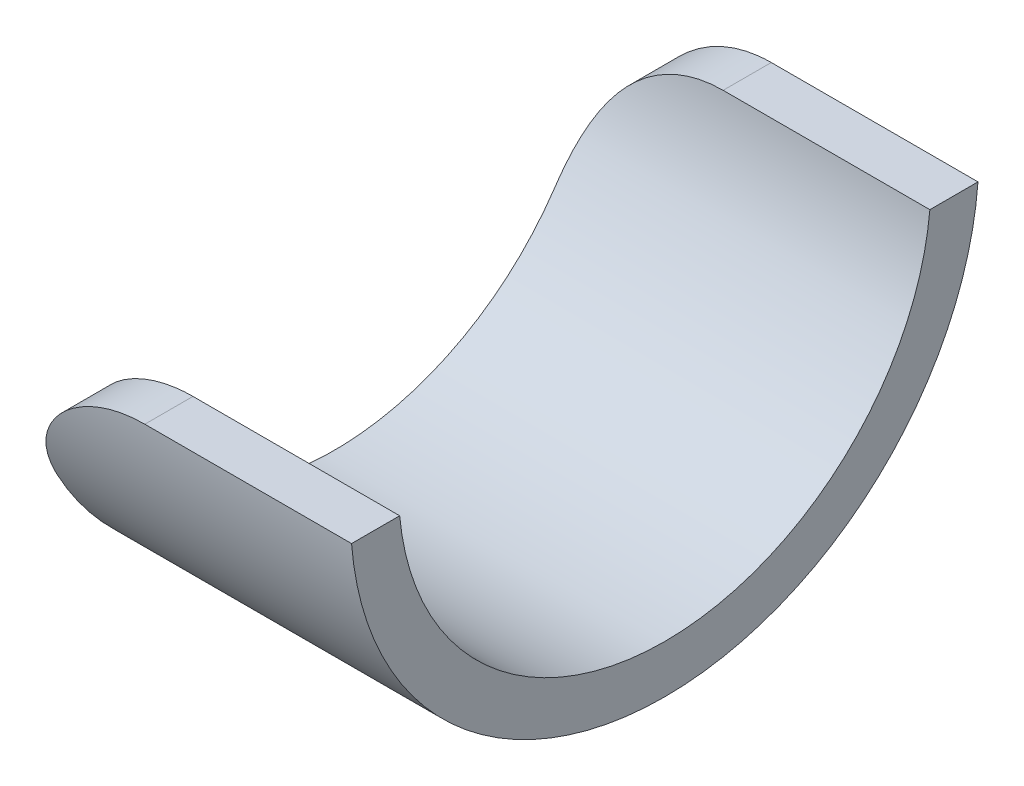
ISO-10303-21;
HEADER;
FILE_DESCRIPTION(('STEP AP214'),'2;1');
FILE_NAME('part.step','',(''),(''),'','','');
FILE_SCHEMA(('AUTOMOTIVE_DESIGN { 1 0 10303 214 1 1 1 1 }'));
ENDSEC;
DATA;
#1=APPLICATION_CONTEXT('core data for automotive mechanical design processes');
#2=APPLICATION_PROTOCOL_DEFINITION('international standard','automotive_design',2000,#1);
#3=PRODUCT_CONTEXT('',#1,'mechanical');
#4=PRODUCT('Part','Part','',(#3));
#5=PRODUCT_RELATED_PRODUCT_CATEGORY('part','',(#4));
#6=PRODUCT_DEFINITION_FORMATION('','',#4);
#7=PRODUCT_DEFINITION_CONTEXT('part definition',#1,'design');
#8=PRODUCT_DEFINITION('design','',#6,#7);
#9=PRODUCT_DEFINITION_SHAPE('','',#8);
#10=(LENGTH_UNIT() NAMED_UNIT(*) SI_UNIT(.MILLI.,.METRE.));
#11=(NAMED_UNIT(*) PLANE_ANGLE_UNIT() SI_UNIT($,.RADIAN.));
#12=(NAMED_UNIT(*) SI_UNIT($,.STERADIAN.) SOLID_ANGLE_UNIT());
#13=UNCERTAINTY_MEASURE_WITH_UNIT(LENGTH_MEASURE(1.E-05),#10,'distance_accuracy_value','');
#14=(GEOMETRIC_REPRESENTATION_CONTEXT(3) GLOBAL_UNCERTAINTY_ASSIGNED_CONTEXT((#13)) GLOBAL_UNIT_ASSIGNED_CONTEXT((#10,
#11,#12)) REPRESENTATION_CONTEXT('',''));
#15=CARTESIAN_POINT('',(0.,0.,0.));
#16=DIRECTION('',(0.,0.,1.));
#17=DIRECTION('',(1.,0.,0.));
#18=AXIS2_PLACEMENT_3D('',#15,#16,#17);
#19=CARTESIAN_POINT('',(25.4,0.,0.));
#20=DIRECTION('',(-1.,0.,0.));
#21=DIRECTION('',(0.,0.,1.));
#22=AXIS2_PLACEMENT_3D('',#19,#20,#21);
#23=CYLINDRICAL_SURFACE('',#22,24.13);
#24=CARTESIAN_POINT('',(0.,0.,0.));
#25=DIRECTION('',(1.,0.,0.));
#26=DIRECTION('',(0.,0.,-1.));
#27=AXIS2_PLACEMENT_3D('',#24,#25,#26);
#28=CIRCLE('',#27,24.13);
#29=CARTESIAN_POINT('',(0.,-11.43,21.2511646739655));
#30=VERTEX_POINT('',#29);
#31=CARTESIAN_POINT('',(0.,-11.43,-21.2511646739655));
#32=VERTEX_POINT('',#31);
#33=EDGE_CURVE('E163',#30,#32,#28,.T.);
#34=ORIENTED_EDGE('',*,*,#33,.T.);
#35=CARTESIAN_POINT('',(0.,-11.43,-21.2511646739655));
#36=CARTESIAN_POINT('',(-2.62243007126413E-05,-11.1860224640543,-21.3824335393108));
#37=CARTESIAN_POINT('',(0.00937477308694025,-10.9396845502003,-21.5094658719944));
#38=CARTESIAN_POINT('',(0.0479236395877504,-10.4439055163118,-21.7544876609394));
#39=CARTESIAN_POINT('',(0.0770830725086785,-10.1944626630503,-21.8724717766096));
#40=CARTESIAN_POINT('',(0.156118837118842,-9.69390311880306,-22.0988883031836));
#41=CARTESIAN_POINT('',(0.206034677985443,-9.44278413916173,-22.2073020174487));
#42=CARTESIAN_POINT('',(0.327202368802155,-8.94150477192952,-22.4138311063666));
#43=CARTESIAN_POINT('',(0.398449861662112,-8.69134419913753,-22.5119485785534));
#44=CARTESIAN_POINT('',(0.562964102877934,-8.19324315777415,-22.6979873973509));
#45=CARTESIAN_POINT('',(0.656316560719896,-7.94531533145705,-22.7858670176028));
#46=CARTESIAN_POINT('',(0.864917743170024,-7.45513554205446,-22.9509202864259));
#47=CARTESIAN_POINT('',(0.980168085088761,-7.21288399968737,-23.0280931434996));
#48=CARTESIAN_POINT('',(1.23201910546764,-6.73697795539725,-23.1717872843801));
#49=CARTESIAN_POINT('',(1.36858542185224,-6.50331035205277,-23.238325368346));
#50=CARTESIAN_POINT('',(1.66250238886438,-6.04664831564512,-23.3613112980713));
#51=CARTESIAN_POINT('',(1.81985155894157,-5.82365312382992,-23.4177598619249));
#52=CARTESIAN_POINT('',(2.14347109553134,-5.40470991060296,-23.5178520749754));
#53=CARTESIAN_POINT('',(2.3085037041298,-5.20794553211169,-23.562088255933));
#54=CARTESIAN_POINT('',(2.65479050631666,-4.82757709066209,-23.6429526368408));
#55=CARTESIAN_POINT('',(2.83604409448118,-4.64397253699317,-23.6795811205675));
#56=CARTESIAN_POINT('',(3.21363852043108,-4.29143598197451,-23.7460034791518));
#57=CARTESIAN_POINT('',(3.40998739998141,-4.12251190492314,-23.7757936768714));
#58=CARTESIAN_POINT('',(3.81630838261891,-3.80087139049984,-23.8293278664702));
#59=CARTESIAN_POINT('',(4.02628051460483,-3.64815498751076,-23.8530718455232));
#60=CARTESIAN_POINT('',(4.45704285565434,-3.36104542848596,-23.895213047223));
#61=CARTESIAN_POINT('',(4.67775947309696,-3.22654644377813,-23.9136419215247));
#62=CARTESIAN_POINT('',(5.12964311440567,-2.97581587645182,-23.9461355713094));
#63=CARTESIAN_POINT('',(5.36081023917931,-2.85958447026916,-23.960200304643));
#64=CARTESIAN_POINT('',(5.831928095831,-2.64628232956131,-23.9846954693647));
#65=CARTESIAN_POINT('',(6.07187653555342,-2.54920663658397,-23.9951268417838));
#66=CARTESIAN_POINT('',(6.55895637291033,-2.37488541721316,-24.0130070257699));
#67=CARTESIAN_POINT('',(6.80608684064031,-2.29763733623003,-24.0204562216298));
#68=CARTESIAN_POINT('',(7.25703859547032,-2.17660389124137,-24.0316919659944));
#69=CARTESIAN_POINT('',(7.45989511606065,-2.12922984902613,-24.0359096588211));
#70=CARTESIAN_POINT('',(7.86827969905803,-2.04787644322711,-24.0429774229925));
#71=CARTESIAN_POINT('',(8.07380739515986,-2.0138952626542,-24.0458276798666));
#72=CARTESIAN_POINT('',(8.48648285909893,-1.95949981658252,-24.0503232209338));
#73=CARTESIAN_POINT('',(8.69362909932989,-1.93907402968682,-24.0519695285443));
#74=CARTESIAN_POINT('',(9.10884950593469,-1.9118178800914,-24.0541447550348));
#75=CARTESIAN_POINT('',(9.31692380045259,-1.90498945704754,-24.0546735144979));
#76=CARTESIAN_POINT('',(9.525,-1.905,-24.0546850945923));
#77=B_SPLINE_CURVE_WITH_KNOTS('',3,(#35,#36,#37,#38,#39,#40,#41,#42,#43,#44,#45,#46,#47,#48,#49,
#50,#51,#52,#53,#54,#55,#56,#57,#58,#59,#60,#61,#62,#63,#64,#65,#66,#67,#68,#69,#70,#71,#72,#73,
#74,#75,#76),.UNSPECIFIED.,.F.,.F.,(4,2,2,2,2,2,2,2,2,2,2,2,2,2,2,2,2,2,2,2,4),(0.,
0.831053790770307,1.66259438406464,2.49572508742816,3.32868573588827,4.16493056434458,
5.0012371793046,5.83620930417523,6.67112197849129,7.45196225401338,8.23277339798149,
9.01400342752858,9.79523511433871,10.5717136526312,11.3481996900133,12.1244844697337,
12.9006691826562,13.5253091224103,14.1498642890198,14.7738879332271,15.3980005876607),.UNSPECIFIED.);
#78=CARTESIAN_POINT('',(9.525,-1.905,-24.0546850945923));
#79=VERTEX_POINT('',#78);
#80=EDGE_CURVE('E41',#32,#79,#77,.T.);
#81=ORIENTED_EDGE('',*,*,#80,.T.);
#82=DIRECTION('',(-1.,0.,0.));
#83=VECTOR('',#82,1.);
#84=CARTESIAN_POINT('',(25.4,-1.905,-24.0546850945923));
#85=LINE('',#84,#83);
#86=CARTESIAN_POINT('',(25.4,-1.905,-24.0546850945923));
#87=VERTEX_POINT('',#86);
#88=EDGE_CURVE('E93',#87,#79,#85,.T.);
#89=ORIENTED_EDGE('',*,*,#88,.F.);
#90=CARTESIAN_POINT('',(25.4,0.,0.));
#91=DIRECTION('',(1.,0.,0.));
#92=DIRECTION('',(0.,0.,-1.));
#93=AXIS2_PLACEMENT_3D('',#90,#91,#92);
#94=CIRCLE('',#93,24.13);
#95=CARTESIAN_POINT('',(25.4,-1.905,24.0546850945923));
#96=VERTEX_POINT('',#95);
#97=EDGE_CURVE('E100',#96,#87,#94,.T.);
#98=ORIENTED_EDGE('',*,*,#97,.F.);
#99=DIRECTION('',(-1.,0.,0.));
#100=VECTOR('',#99,1.);
#101=CARTESIAN_POINT('',(25.4,-1.905,24.0546850945923));
#102=LINE('',#101,#100);
#103=CARTESIAN_POINT('',(9.525,-1.905,24.0546850945923));
#104=VERTEX_POINT('',#103);
#105=EDGE_CURVE('E182',#96,#104,#102,.T.);
#106=ORIENTED_EDGE('',*,*,#105,.T.);
#107=CARTESIAN_POINT('',(9.525,-1.905,24.0546850945923));
#108=CARTESIAN_POINT('',(9.25902855860662,-1.90497112249098,24.0546543706783));
#109=CARTESIAN_POINT('',(8.99305996792605,-1.91613908815105,24.0538018907344));
#110=CARTESIAN_POINT('',(8.46300387273561,-1.9606612994031,24.0502314004206));
#111=CARTESIAN_POINT('',(8.1989163303127,-1.99401509654734,24.0475134277582));
#112=CARTESIAN_POINT('',(7.67456650786336,-2.08268810274374,24.0399910936523));
#113=CARTESIAN_POINT('',(7.41430308962371,-2.1380006327919,24.0351873665735));
#114=CARTESIAN_POINT('',(6.89937138401652,-2.2701777631287,24.0230644040504));
#115=CARTESIAN_POINT('',(6.6447029998715,-2.34704199031998,24.0157452121526));
#116=CARTESIAN_POINT('',(6.14260206552165,-2.52181707329971,23.9980216823762));
#117=CARTESIAN_POINT('',(5.89517469334633,-2.61974259140439,23.9876151932781));
#118=CARTESIAN_POINT('',(5.40953230749561,-2.83586324053376,23.9630257307452));
#119=CARTESIAN_POINT('',(5.17131717562001,-2.9540581113811,23.9488428057835));
#120=CARTESIAN_POINT('',(4.70588661033124,-3.20976539159897,23.9159133288637));
#121=CARTESIAN_POINT('',(4.47866874681592,-3.34727350681213,23.8971677906916));
#122=CARTESIAN_POINT('',(4.03685190596719,-3.64051036300694,23.8542560267361));
#123=CARTESIAN_POINT('',(3.82225273297257,-3.79623882135804,23.8300898850306));
#124=CARTESIAN_POINT('',(3.40913310360506,-4.12311644738061,23.7757019327644));
#125=CARTESIAN_POINT('',(3.21048485846543,-4.29411352349554,23.7455368268045));
#126=CARTESIAN_POINT('',(2.82856447170116,-4.65123007876344,23.6781748356056));
#127=CARTESIAN_POINT('',(2.64529225956836,-4.8373494885639,23.6409779826139));
#128=CARTESIAN_POINT('',(2.29548581756171,-5.22294907941939,23.5587888909164));
#129=CARTESIAN_POINT('',(2.12894399446347,-5.42242313023072,23.5138002140805));
#130=CARTESIAN_POINT('',(1.81359856584554,-5.83295582002549,23.4153383321293));
#131=CARTESIAN_POINT('',(1.6647945124326,-6.04401416629933,23.3618653413296));
#132=CARTESIAN_POINT('',(1.38874855215797,-6.47113711214399,23.2471317644862));
#133=CARTESIAN_POINT('',(1.26111596507832,-6.68700031712436,23.1860605993367));
#134=CARTESIAN_POINT('',(1.02423098390503,-7.12596104699,23.0549352631465));
#135=CARTESIAN_POINT('',(0.914978750332491,-7.34905863503499,22.9848810136632));
#136=CARTESIAN_POINT('',(0.715071957252479,-7.80069709441672,22.8355565811858));
#137=CARTESIAN_POINT('',(0.624434549431874,-8.02924277118396,22.7562780033086));
#138=CARTESIAN_POINT('',(0.461930113313286,-8.48959759740636,22.5885730040502));
#139=CARTESIAN_POINT('',(0.390061506300686,-8.72140647065202,22.5001473529379));
#140=CARTESIAN_POINT('',(0.271603413772416,-9.16141574281794,22.3243212812767));
#141=CARTESIAN_POINT('',(0.223127464472969,-9.36947657204716,22.2378315842086));
#142=CARTESIAN_POINT('',(0.140643449883782,-9.7854805725289,22.0579381550127));
#143=CARTESIAN_POINT('',(0.106635777848727,-9.99342374042991,21.9645342350342));
#144=CARTESIAN_POINT('',(0.0527401220690146,-10.4075477143405,21.771354509249));
#145=CARTESIAN_POINT('',(0.0328187663108996,-10.6137315346706,21.6715943779708));
#146=CARTESIAN_POINT('',(0.00644491721495352,-11.0238100019182,21.4659113001518));
#147=CARTESIAN_POINT('',(-1.12453408408947E-05,-11.2277052573949,21.3599900405856));
#148=CARTESIAN_POINT('',(0.,-11.43,21.2511646739655));
#149=B_SPLINE_CURVE_WITH_KNOTS('',3,(#107,#108,#109,#110,#111,#112,#113,#114,#115,#116,#117,
#118,#119,#120,#121,#122,#123,#124,#125,#126,#127,#128,#129,#130,#131,#132,#133,#134,#135,#136,
#137,#138,#139,#140,#141,#142,#143,#144,#145,#146,#147,#148),.UNSPECIFIED.,.F.,.F.,(4,2,2,2,2,2,
2,2,2,2,2,2,2,2,2,2,2,2,2,2,4),(0.,0.797674807200183,1.59533349129078,2.39274974387176,
3.19015219264293,3.98811157936095,4.78606072424157,5.58383273105668,6.38159236462163,
7.17214191497642,7.96268783999794,8.75287333268876,9.54303886831846,10.316430031771,
11.0898279491281,11.8639353089751,12.6379775347455,13.3288503903548,14.0197420230188,
14.7089913240004,15.3980527824104),.UNSPECIFIED.);
#150=EDGE_CURVE('E48',#104,#30,#149,.T.);
#151=ORIENTED_EDGE('',*,*,#150,.T.);
#152=EDGE_LOOP('',(#34,#81,#89,#98,#106,#151));
#153=FACE_BOUND('',#152,.T.);
#154=ADVANCED_FACE('F32',(#153),#23,.T.);
#155=CARTESIAN_POINT('',(25.4,-1.905,-20.3580643480661));
#156=DIRECTION('',(0.,-1.,0.));
#157=DIRECTION('',(0.,0.,-1.));
#158=AXIS2_PLACEMENT_3D('',#155,#156,#157);
#159=PLANE('',#158);
#160=ORIENTED_EDGE('',*,*,#88,.T.);
#161=DIRECTION('',(0.,0.,1.));
#162=VECTOR('',#161,1.);
#163=CARTESIAN_POINT('',(9.525,-1.905,-20.3580643480661));
#164=LINE('',#163,#162);
#165=CARTESIAN_POINT('',(9.525,-1.905,-20.3580643480661));
#166=VERTEX_POINT('',#165);
#167=EDGE_CURVE('E112',#79,#166,#164,.T.);
#168=ORIENTED_EDGE('',*,*,#167,.T.);
#169=DIRECTION('',(-1.,0.,0.));
#170=VECTOR('',#169,1.);
#171=CARTESIAN_POINT('',(25.4,-1.905,-20.3580643480661));
#172=LINE('',#171,#170);
#173=CARTESIAN_POINT('',(25.4,-1.905,-20.3580643480661));
#174=VERTEX_POINT('',#173);
#175=EDGE_CURVE('E96',#174,#166,#172,.T.);
#176=ORIENTED_EDGE('',*,*,#175,.F.);
#177=DIRECTION('',(0.,0.,1.));
#178=VECTOR('',#177,1.);
#179=CARTESIAN_POINT('',(25.4,-1.905,-20.3580643480661));
#180=LINE('',#179,#178);
#181=EDGE_CURVE('E88',#87,#174,#180,.T.);
#182=ORIENTED_EDGE('',*,*,#181,.F.);
#183=EDGE_LOOP('',(#160,#168,#176,#182));
#184=FACE_BOUND('',#183,.T.);
#185=ADVANCED_FACE('F90',(#184),#159,.F.);
#186=CARTESIAN_POINT('',(25.4,0.,0.));
#187=DIRECTION('',(-1.,0.,0.));
#188=DIRECTION('',(0.,0.,1.));
#189=AXIS2_PLACEMENT_3D('',#186,#187,#188);
#190=CYLINDRICAL_SURFACE('',#189,20.447);
#191=ORIENTED_EDGE('',*,*,#175,.T.);
#192=CARTESIAN_POINT('',(9.525,-1.905,-20.3580643480661));
#193=CARTESIAN_POINT('',(9.25978977014526,-1.90497110377044,-20.3580283743182));
#194=CARTESIAN_POINT('',(8.99458190205295,-1.91607541741178,-20.3570267347558));
#195=CARTESIAN_POINT('',(8.46603330595991,-1.96034336128463,-20.352832188804));
#196=CARTESIAN_POINT('',(8.20269256023756,-1.99350678186011,-20.3496393032408));
#197=CARTESIAN_POINT('',(7.67976710818044,-2.08168051639916,-20.3408028731761));
#198=CARTESIAN_POINT('',(7.42018195184562,-2.13668819010333,-20.3351596248361));
#199=CARTESIAN_POINT('',(6.9065823565463,-2.26813517562933,-20.3209194671558));
#200=CARTESIAN_POINT('',(6.65256781040154,-2.34457407471702,-20.312322614697));
#201=CARTESIAN_POINT('',(6.15172905872527,-2.51837915517059,-20.2915062917797));
#202=CARTESIAN_POINT('',(5.90491062304745,-2.61576163208616,-20.2792839976529));
#203=CARTESIAN_POINT('',(5.42046974204375,-2.83065885374987,-20.2504056126832));
#204=CARTESIAN_POINT('',(5.18284713201861,-2.94817323772638,-20.2337496012912));
#205=CARTESIAN_POINT('',(4.71860313323052,-3.20235227155138,-20.1950801117434));
#206=CARTESIAN_POINT('',(4.49197903223694,-3.33901216747872,-20.1730679625452));
#207=CARTESIAN_POINT('',(4.05136405145136,-3.63034088398203,-20.1226806227278));
#208=CARTESIAN_POINT('',(3.83737292244127,-3.78500934911329,-20.0943055576867));
#209=CARTESIAN_POINT('',(3.42620891630364,-4.10893379759801,-20.030560824482));
#210=CARTESIAN_POINT('',(3.22885954487623,-4.27798374878302,-19.9952828225731));
#211=CARTESIAN_POINT('',(2.84947281277147,-4.63073177356297,-19.9165452957226));
#212=CARTESIAN_POINT('',(2.66743532964771,-4.81442972999756,-19.8730858362156));
#213=CARTESIAN_POINT('',(2.32005992918782,-5.19456017598146,-19.7771267369428));
#214=CARTESIAN_POINT('',(2.15471065709082,-5.39098385541035,-19.724633310632));
#215=CARTESIAN_POINT('',(1.84162833815016,-5.79469430757571,-19.6098279166227));
#216=CARTESIAN_POINT('',(1.69389475833076,-6.00198075137795,-19.5475162461149));
#217=CARTESIAN_POINT('',(1.42089667288137,-6.41906899364777,-19.4144755131979));
#218=CARTESIAN_POINT('',(1.29510049382968,-6.62861897179975,-19.3440467118341));
#219=CARTESIAN_POINT('',(1.06130049022161,-7.05389488573657,-19.1930529525103));
#220=CARTESIAN_POINT('',(0.953296570547871,-7.26962078849771,-19.112488048742));
#221=CARTESIAN_POINT('',(0.755103699314461,-7.70549373801177,-18.9409635820805));
#222=CARTESIAN_POINT('',(0.664940401084745,-7.92564665685008,-18.8499893436497));
#223=CARTESIAN_POINT('',(0.50249570259122,-8.36804475355946,-18.6578079286869));
#224=CARTESIAN_POINT('',(0.430213517538051,-8.59028983916225,-18.5566012015262));
#225=CARTESIAN_POINT('',(0.303153739250019,-9.03487826701944,-18.3442481822495));
#226=CARTESIAN_POINT('',(0.248367946006984,-9.25722151419619,-18.23310657765));
#227=CARTESIAN_POINT('',(0.155607328845854,-9.70043791104361,-18.0012194838147));
#228=CARTESIAN_POINT('',(0.117635672778708,-9.92131077597413,-17.8804721898794));
#229=CARTESIAN_POINT('',(0.057778548534097,-10.3594428106769,-17.6302342348168));
#230=CARTESIAN_POINT('',(0.0358505781251143,-10.5767100272518,-17.5007676745597));
#231=CARTESIAN_POINT('',(0.00695864841239081,-11.0068892110165,-17.2334730625406));
#232=CARTESIAN_POINT('',(-1.40946185446643E-05,-11.2198036619075,-17.0956499678064));
#233=CARTESIAN_POINT('',(0.,-11.43,-16.9539054202859));
#234=B_SPLINE_CURVE_WITH_KNOTS('',3,(#192,#193,#194,#195,#196,#197,#198,#199,#200,#201,#202,
#203,#204,#205,#206,#207,#208,#209,#210,#211,#212,#213,#214,#215,#216,#217,#218,#219,#220,#221,
#222,#223,#224,#225,#226,#227,#228,#229,#230,#231,#232,#233),.UNSPECIFIED.,.F.,.F.,(4,2,2,2,2,2,
2,2,2,2,2,2,2,2,2,2,2,2,2,2,4),(0.,0.795393423654686,1.59077928777243,2.38606904486716,
3.18134348689319,3.97723896055609,4.77312017295292,5.5688041133931,6.3644723516572,
7.15021538340832,7.93595213111672,8.72115060258975,9.5063253112738,10.2684854549721,
11.0306415240326,11.7938856708571,12.5570963134924,13.319948736603,14.082944823085,
14.8439122217054,15.604432555074),.UNSPECIFIED.);
#235=CARTESIAN_POINT('',(0.,-11.43,-16.9539054202859));
#236=VERTEX_POINT('',#235);
#237=EDGE_CURVE('E126',#166,#236,#234,.T.);
#238=ORIENTED_EDGE('',*,*,#237,.T.);
#239=CARTESIAN_POINT('',(0.,0.,0.));
#240=DIRECTION('',(-1.,0.,0.));
#241=DIRECTION('',(0.,0.,-1.));
#242=AXIS2_PLACEMENT_3D('',#239,#240,#241);
#243=CIRCLE('',#242,20.447);
#244=CARTESIAN_POINT('',(0.,-11.43,16.9539054202859));
#245=VERTEX_POINT('',#244);
#246=EDGE_CURVE('E109',#236,#245,#243,.T.);
#247=ORIENTED_EDGE('',*,*,#246,.T.);
#248=CARTESIAN_POINT('',(0.,-11.43,16.9539054202859));
#249=CARTESIAN_POINT('',(-2.26556267190623E-05,-11.1970109347333,17.1110348965797));
#250=CARTESIAN_POINT('',(0.00854996527283876,-10.9606584924522,17.2633409521735));
#251=CARTESIAN_POINT('',(0.0441943253259937,-10.4827345096676,17.557631634213));
#252=CARTESIAN_POINT('',(0.0712805745076498,-10.241159019522,17.6996080681937));
#253=CARTESIAN_POINT('',(0.145377805371788,-9.75392492005596,17.9727321356884));
#254=CARTESIAN_POINT('',(0.192449364536353,-9.50825609668595,18.1038453856936));
#255=CARTESIAN_POINT('',(0.307566450309029,-9.01577956315671,18.3540664977231));
#256=CARTESIAN_POINT('',(0.375606449191654,-8.76897217001962,18.4731775128226));
#257=CARTESIAN_POINT('',(0.53383245903843,-8.27531248509759,18.6995490297245));
#258=CARTESIAN_POINT('',(0.624131647136172,-8.02846661678016,18.8067447749873));
#259=CARTESIAN_POINT('',(0.827078092665168,-7.53872313086899,19.0083559040058));
#260=CARTESIAN_POINT('',(0.939727382262767,-7.29582587447428,19.1027701242966));
#261=CARTESIAN_POINT('',(1.18702756275254,-6.81738744881128,19.2786895398164));
#262=CARTESIAN_POINT('',(1.32162936657595,-6.58183123312698,19.3602227547461));
#263=CARTESIAN_POINT('',(1.61248686004771,-6.12037421258529,19.5110161349573));
#264=CARTESIAN_POINT('',(1.76874040418349,-5.89447245394763,19.580277514731));
#265=CARTESIAN_POINT('',(2.08719310004087,-5.47451213954638,19.7015990829017));
#266=CARTESIAN_POINT('',(2.24764088450731,-5.27940511020473,19.7546393047696));
#267=CARTESIAN_POINT('',(2.58476100175011,-4.90138340496377,19.8518094278578));
#268=CARTESIAN_POINT('',(2.76143244282964,-4.71846805992848,19.8959398183609));
#269=CARTESIAN_POINT('',(3.12994468473486,-4.36644050139834,19.976151579886));
#270=CARTESIAN_POINT('',(3.32179551996768,-4.19733757130689,20.0122275652699));
#271=CARTESIAN_POINT('',(3.7192248194697,-3.87459604014138,20.0772114901172));
#272=CARTESIAN_POINT('',(3.92480339005321,-3.72095755885468,20.1061193740592));
#273=CARTESIAN_POINT('',(4.34587685286661,-3.43207667548693,20.1574291495039));
#274=CARTESIAN_POINT('',(4.56123652101523,-3.29664918935762,20.1798996243166));
#275=CARTESIAN_POINT('',(5.00256224098035,-3.04322714023593,20.2196697315629));
#276=CARTESIAN_POINT('',(5.22853303698627,-2.92524047465008,20.2369670251252));
#277=CARTESIAN_POINT('',(5.68939336395446,-2.7076913191788,20.2672218373143));
#278=CARTESIAN_POINT('',(5.92428109734117,-2.6081251394077,20.2801802255078));
#279=CARTESIAN_POINT('',(6.40133118829256,-2.42815162760385,20.3025150068543));
#280=CARTESIAN_POINT('',(6.64349011485936,-2.34773541457401,20.3118930616464));
#281=CARTESIAN_POINT('',(7.10242990400114,-2.21553591633533,20.3267077281063));
#282=CARTESIAN_POINT('',(7.31852976669072,-2.16141368417318,20.3324935680789));
#283=CARTESIAN_POINT('',(7.75401731871972,-2.06843955546321,20.3421616557291));
#284=CARTESIAN_POINT('',(7.97340471224863,-2.02958629348418,20.3460440736285));
#285=CARTESIAN_POINT('',(8.41426514810789,-1.96736786921801,20.352157279265));
#286=CARTESIAN_POINT('',(8.63573700720965,-1.94399440122065,20.3543889527872));
#287=CARTESIAN_POINT('',(9.0798052484316,-1.91280264393239,20.3573335916408));
#288=CARTESIAN_POINT('',(9.30240173911299,-1.9049858862538,20.358046407436));
#289=CARTESIAN_POINT('',(9.525,-1.905,20.3580643480661));
#290=B_SPLINE_CURVE_WITH_KNOTS('',3,(#248,#249,#250,#251,#252,#253,#254,#255,#256,#257,#258,
#259,#260,#261,#262,#263,#264,#265,#266,#267,#268,#269,#270,#271,#272,#273,#274,#275,#276,#277,
#278,#279,#280,#281,#282,#283,#284,#285,#286,#287,#288,#289),.UNSPECIFIED.,.F.,.F.,(4,2,2,2,2,2,
2,2,2,2,2,2,2,2,2,2,2,2,2,2,4),(0.,0.843012231859918,1.68668593203055,2.53293535688566,
3.37896188300092,4.22938213047316,5.07987973723859,5.92850102018458,6.77703827167067,
7.55044553476625,8.32381031468301,9.09769067222045,9.87157702376157,10.6368826673749,
11.4025337956783,12.1680313867012,12.9331732758271,13.6011795842373,14.2691261424273,
14.9367140217581,15.6043676241904),.UNSPECIFIED.);
#291=CARTESIAN_POINT('',(9.525,-1.905,20.3580643480661));
#292=VERTEX_POINT('',#291);
#293=EDGE_CURVE('E114',#245,#292,#290,.T.);
#294=ORIENTED_EDGE('',*,*,#293,.T.);
#295=DIRECTION('',(-1.,0.,0.));
#296=VECTOR('',#295,1.);
#297=CARTESIAN_POINT('',(25.4,-1.905,20.3580643480661));
#298=LINE('',#297,#296);
#299=CARTESIAN_POINT('',(25.4,-1.905,20.3580643480661));
#300=VERTEX_POINT('',#299);
#301=EDGE_CURVE('E116',#300,#292,#298,.T.);
#302=ORIENTED_EDGE('',*,*,#301,.F.);
#303=CARTESIAN_POINT('',(25.4,0.,0.));
#304=DIRECTION('',(-1.,0.,0.));
#305=DIRECTION('',(0.,0.,-1.));
#306=AXIS2_PLACEMENT_3D('',#303,#304,#305);
#307=CIRCLE('',#306,20.447);
#308=EDGE_CURVE('E99',#174,#300,#307,.T.);
#309=ORIENTED_EDGE('',*,*,#308,.F.);
#310=EDGE_LOOP('',(#191,#238,#247,#294,#302,#309));
#311=FACE_BOUND('',#310,.T.);
#312=ADVANCED_FACE('F132',(#311),#190,.F.);
#313=CARTESIAN_POINT('',(25.4,-1.905,24.0546850945923));
#314=DIRECTION('',(0.,-1.,0.));
#315=DIRECTION('',(0.,0.,-1.));
#316=AXIS2_PLACEMENT_3D('',#313,#314,#315);
#317=PLANE('',#316);
#318=ORIENTED_EDGE('',*,*,#301,.T.);
#319=DIRECTION('',(0.,0.,1.));
#320=VECTOR('',#319,1.);
#321=CARTESIAN_POINT('',(9.525,-1.905,24.0546850945923));
#322=LINE('',#321,#320);
#323=EDGE_CURVE('E11',#292,#104,#322,.T.);
#324=ORIENTED_EDGE('',*,*,#323,.T.);
#325=ORIENTED_EDGE('',*,*,#105,.F.);
#326=DIRECTION('',(0.,0.,1.));
#327=VECTOR('',#326,1.);
#328=CARTESIAN_POINT('',(25.4,-1.905,24.0546850945923));
#329=LINE('',#328,#327);
#330=EDGE_CURVE('E105',#300,#96,#329,.T.);
#331=ORIENTED_EDGE('',*,*,#330,.F.);
#332=EDGE_LOOP('',(#318,#324,#325,#331));
#333=FACE_BOUND('',#332,.T.);
#334=ADVANCED_FACE('F137',(#333),#317,.F.);
#335=CARTESIAN_POINT('',(25.4,0.,0.));
#336=DIRECTION('',(1.,0.,0.));
#337=DIRECTION('',(0.,0.,-1.));
#338=AXIS2_PLACEMENT_3D('',#335,#336,#337);
#339=PLANE('',#338);
#340=ORIENTED_EDGE('',*,*,#97,.T.);
#341=ORIENTED_EDGE('',*,*,#181,.T.);
#342=ORIENTED_EDGE('',*,*,#308,.T.);
#343=ORIENTED_EDGE('',*,*,#330,.T.);
#344=EDGE_LOOP('',(#340,#341,#342,#343));
#345=FACE_BOUND('',#344,.T.);
#346=ADVANCED_FACE('F103',(#345),#339,.T.);
#347=CARTESIAN_POINT('',(0.,0.,0.));
#348=DIRECTION('',(1.,0.,0.));
#349=DIRECTION('',(0.,0.,-1.));
#350=AXIS2_PLACEMENT_3D('',#347,#348,#349);
#351=PLANE('',#350);
#352=ORIENTED_EDGE('',*,*,#246,.F.);
#353=DIRECTION('',(0.,0.,1.));
#354=VECTOR('',#353,1.);
#355=CARTESIAN_POINT('',(0.,-11.43,0.));
#356=LINE('',#355,#354);
#357=EDGE_CURVE('E55',#236,#32,#356,.F.);
#358=ORIENTED_EDGE('',*,*,#357,.T.);
#359=ORIENTED_EDGE('',*,*,#33,.F.);
#360=DIRECTION('',(0.,0.,1.));
#361=VECTOR('',#360,1.);
#362=CARTESIAN_POINT('',(0.,-11.43,0.));
#363=LINE('',#362,#361);
#364=EDGE_CURVE('E158',#30,#245,#363,.F.);
#365=ORIENTED_EDGE('',*,*,#364,.T.);
#366=EDGE_LOOP('',(#352,#358,#359,#365));
#367=FACE_BOUND('',#366,.T.);
#368=ADVANCED_FACE('F162',(#367),#351,.F.);
#369=CARTESIAN_POINT('',(9.525,-11.43,-20.3580643480661));
#370=DIRECTION('',(0.,0.,1.));
#371=DIRECTION('',(1.,0.,0.));
#372=AXIS2_PLACEMENT_3D('',#369,#370,#371);
#373=CYLINDRICAL_SURFACE('',#372,9.525);
#374=ORIENTED_EDGE('',*,*,#80,.F.);
#375=ORIENTED_EDGE('',*,*,#357,.F.);
#376=ORIENTED_EDGE('',*,*,#237,.F.);
#377=ORIENTED_EDGE('',*,*,#167,.F.);
#378=EDGE_LOOP('',(#374,#375,#376,#377));
#379=FACE_BOUND('',#378,.T.);
#380=ADVANCED_FACE('F145',(#379),#373,.T.);
#381=CARTESIAN_POINT('',(9.525,-11.43,24.0546850945923));
#382=DIRECTION('',(0.,0.,1.));
#383=DIRECTION('',(1.,0.,0.));
#384=AXIS2_PLACEMENT_3D('',#381,#382,#383);
#385=CYLINDRICAL_SURFACE('',#384,9.525);
#386=ORIENTED_EDGE('',*,*,#293,.F.);
#387=ORIENTED_EDGE('',*,*,#364,.F.);
#388=ORIENTED_EDGE('',*,*,#150,.F.);
#389=ORIENTED_EDGE('',*,*,#323,.F.);
#390=EDGE_LOOP('',(#386,#387,#388,#389));
#391=FACE_BOUND('',#390,.T.);
#392=ADVANCED_FACE('F34',(#391),#385,.T.);
#393=CLOSED_SHELL('',(#154,#185,#312,#334,#346,#368,#380,#392));
#394=MANIFOLD_SOLID_BREP('B2',#393);
#395=ADVANCED_BREP_SHAPE_REPRESENTATION('',(#18,#394),#14);
#396=SHAPE_DEFINITION_REPRESENTATION(#9,#395);
ENDSEC;
END-ISO-10303-21;
